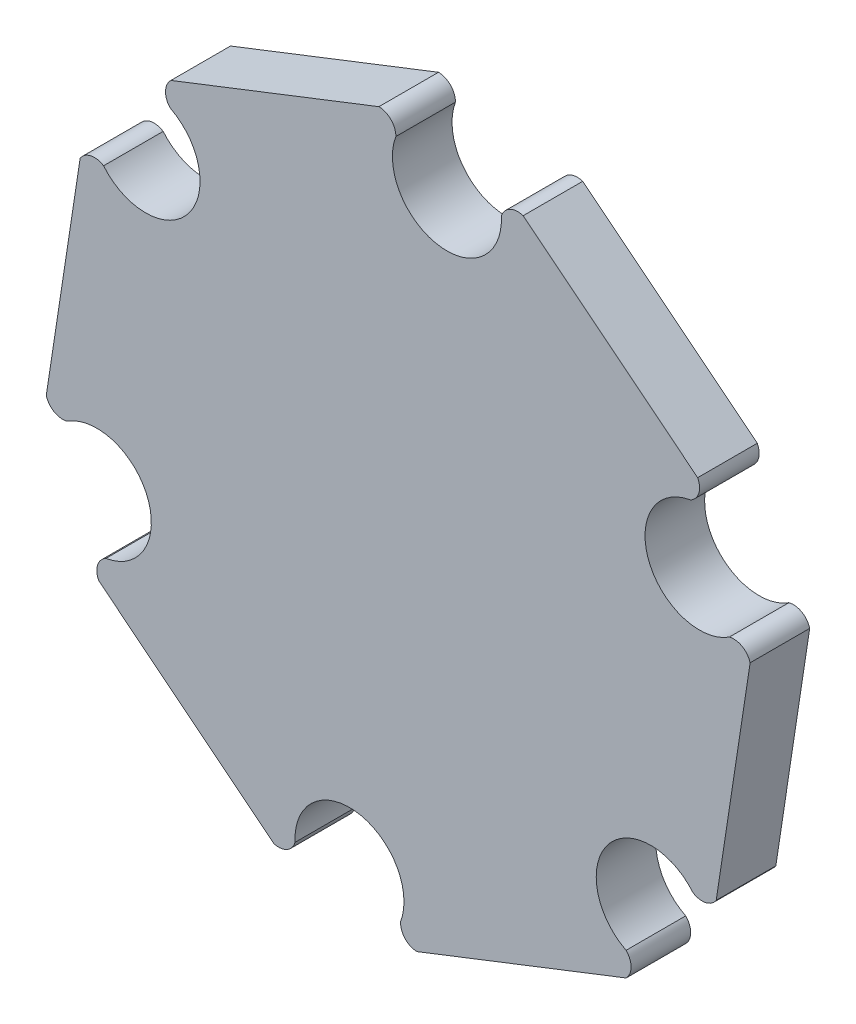
ISO-10303-21;
HEADER;
FILE_DESCRIPTION(('STEP AP214'),'2;1');
FILE_NAME('part.step','',(''),(''),'','','');
FILE_SCHEMA(('AUTOMOTIVE_DESIGN { 1 0 10303 214 1 1 1 1 }'));
ENDSEC;
DATA;
#1=APPLICATION_CONTEXT('core data for automotive mechanical design processes');
#2=APPLICATION_PROTOCOL_DEFINITION('international standard','automotive_design',2000,#1);
#3=PRODUCT_CONTEXT('',#1,'mechanical');
#4=PRODUCT('Part','Part','',(#3));
#5=PRODUCT_RELATED_PRODUCT_CATEGORY('part','',(#4));
#6=PRODUCT_DEFINITION_FORMATION('','',#4);
#7=PRODUCT_DEFINITION_CONTEXT('part definition',#1,'design');
#8=PRODUCT_DEFINITION('design','',#6,#7);
#9=PRODUCT_DEFINITION_SHAPE('','',#8);
#10=(LENGTH_UNIT() NAMED_UNIT(*) SI_UNIT(.MILLI.,.METRE.));
#11=(NAMED_UNIT(*) PLANE_ANGLE_UNIT() SI_UNIT($,.RADIAN.));
#12=(NAMED_UNIT(*) SI_UNIT($,.STERADIAN.) SOLID_ANGLE_UNIT());
#13=UNCERTAINTY_MEASURE_WITH_UNIT(LENGTH_MEASURE(1.E-05),#10,'distance_accuracy_value','');
#14=(GEOMETRIC_REPRESENTATION_CONTEXT(3) GLOBAL_UNCERTAINTY_ASSIGNED_CONTEXT((#13)) GLOBAL_UNIT_ASSIGNED_CONTEXT((#10,
#11,#12)) REPRESENTATION_CONTEXT('',''));
#15=CARTESIAN_POINT('',(0.,0.,0.));
#16=DIRECTION('',(0.,0.,1.));
#17=DIRECTION('',(1.,0.,0.));
#18=AXIS2_PLACEMENT_3D('',#15,#16,#17);
#19=CARTESIAN_POINT('',(-23.0759580428139,-0.467663959101005,1.75));
#20=DIRECTION('',(0.,0.,-1.));
#21=DIRECTION('',(-1.,0.,0.));
#22=AXIS2_PLACEMENT_3D('',#19,#20,#21);
#23=CYLINDRICAL_SURFACE('',#22,0.498378190085756);
#24=CARTESIAN_POINT('',(-23.0759580428139,-0.467663959101005,0.));
#25=DIRECTION('',(0.,0.,1.));
#26=DIRECTION('',(1.,0.,0.));
#27=AXIS2_PLACEMENT_3D('',#24,#25,#26);
#28=CIRCLE('',#27,0.498378190085756);
#29=CARTESIAN_POINT('',(-23.5180099099412,-0.697818183747076,0.));
#30=VERTEX_POINT('',#29);
#31=CARTESIAN_POINT('',(-23.3061122674605,-0.0256120919740345,0.));
#32=VERTEX_POINT('',#31);
#33=EDGE_CURVE('E224',#30,#32,#28,.F.);
#34=ORIENTED_EDGE('',*,*,#33,.F.);
#35=DIRECTION('',(0.,0.,-1.));
#36=VECTOR('',#35,1.);
#37=CARTESIAN_POINT('',(-23.5180099099412,-0.697818183747076,1.75));
#38=LINE('',#37,#36);
#39=CARTESIAN_POINT('',(-23.5180099099412,-0.697818183747076,1.75));
#40=VERTEX_POINT('',#39);
#41=EDGE_CURVE('E11',#40,#30,#38,.T.);
#42=ORIENTED_EDGE('',*,*,#41,.F.);
#43=CARTESIAN_POINT('',(-23.0759580428139,-0.467663959101005,1.75));
#44=DIRECTION('',(0.,0.,1.));
#45=DIRECTION('',(1.,0.,0.));
#46=AXIS2_PLACEMENT_3D('',#43,#44,#45);
#47=CIRCLE('',#46,0.498378190085756);
#48=CARTESIAN_POINT('',(-23.3061122674605,-0.0256120919740345,1.75));
#49=VERTEX_POINT('',#48);
#50=EDGE_CURVE('E292',#40,#49,#47,.F.);
#51=ORIENTED_EDGE('',*,*,#50,.T.);
#52=DIRECTION('',(0.,0.,-1.));
#53=VECTOR('',#52,1.);
#54=CARTESIAN_POINT('',(-23.3061122674605,-0.0256120919740345,1.75));
#55=LINE('',#54,#53);
#56=EDGE_CURVE('E50',#49,#32,#55,.T.);
#57=ORIENTED_EDGE('',*,*,#56,.T.);
#58=EDGE_LOOP('',(#34,#42,#51,#57));
#59=FACE_BOUND('',#58,.T.);
#60=ADVANCED_FACE('F34',(#59),#23,.T.);
#61=CARTESIAN_POINT('',(-9.51815907888062,-11.8976988485981,1.75));
#62=DIRECTION('',(0.624695047554511,0.780868809442961,0.));
#63=DIRECTION('',(-0.780868809442961,0.624695047554511,0.));
#64=AXIS2_PLACEMENT_3D('',#61,#62,#63);
#65=PLANE('',#64);
#66=DIRECTION('',(0.780868809442961,-0.624695047554511,0.));
#67=VECTOR('',#66,1.);
#68=CARTESIAN_POINT('',(-9.51815907888062,-11.8976988485981,0.));
#69=LINE('',#68,#67);
#70=CARTESIAN_POINT('',(-18.3710955944245,-4.81534963616135,0.));
#71=VERTEX_POINT('',#70);
#72=EDGE_CURVE('E226',#30,#71,#69,.T.);
#73=ORIENTED_EDGE('',*,*,#72,.T.);
#74=DIRECTION('',(0.,0.,-1.));
#75=VECTOR('',#74,1.);
#76=CARTESIAN_POINT('',(-18.3710955944245,-4.81534963616135,1.75));
#77=LINE('',#76,#75);
#78=CARTESIAN_POINT('',(-18.3710955944245,-4.81534963616135,1.75));
#79=VERTEX_POINT('',#78);
#80=EDGE_CURVE('E42',#79,#71,#77,.T.);
#81=ORIENTED_EDGE('',*,*,#80,.F.);
#82=DIRECTION('',(0.780868809442961,-0.624695047554511,0.));
#83=VECTOR('',#82,1.);
#84=CARTESIAN_POINT('',(-9.51815907888062,-11.8976988485981,1.75));
#85=LINE('',#84,#83);
#86=EDGE_CURVE('E353',#40,#79,#85,.T.);
#87=ORIENTED_EDGE('',*,*,#86,.F.);
#88=ORIENTED_EDGE('',*,*,#41,.T.);
#89=EDGE_LOOP('',(#73,#81,#87,#88));
#90=FACE_BOUND('',#89,.T.);
#91=ADVANCED_FACE('F340',(#90),#65,.F.);
#92=CARTESIAN_POINT('',(-18.2347643282595,-4.33257715894294,1.75));
#93=DIRECTION('',(0.,0.,-1.));
#94=DIRECTION('',(-1.,0.,0.));
#95=AXIS2_PLACEMENT_3D('',#92,#93,#94);
#96=CYLINDRICAL_SURFACE('',#95,0.501652747319982);
#97=CARTESIAN_POINT('',(-18.2347643282595,-4.33257715894294,0.));
#98=DIRECTION('',(0.,0.,1.));
#99=DIRECTION('',(1.,0.,0.));
#100=AXIS2_PLACEMENT_3D('',#97,#98,#99);
#101=CIRCLE('',#100,0.501652747319982);
#102=CARTESIAN_POINT('',(-17.7519918510414,-4.46890842510842,0.));
#103=VERTEX_POINT('',#102);
#104=EDGE_CURVE('E229',#103,#71,#101,.F.);
#105=ORIENTED_EDGE('',*,*,#104,.F.);
#106=DIRECTION('',(0.,0.,-1.));
#107=VECTOR('',#106,1.);
#108=CARTESIAN_POINT('',(-17.7519918510414,-4.46890842510842,1.75));
#109=LINE('',#108,#107);
#110=CARTESIAN_POINT('',(-17.7519918510414,-4.46890842510842,1.75));
#111=VERTEX_POINT('',#110);
#112=EDGE_CURVE('E330',#111,#103,#109,.T.);
#113=ORIENTED_EDGE('',*,*,#112,.F.);
#114=CARTESIAN_POINT('',(-18.2347643282595,-4.33257715894294,1.75));
#115=DIRECTION('',(0.,0.,1.));
#116=DIRECTION('',(1.,0.,0.));
#117=AXIS2_PLACEMENT_3D('',#114,#115,#116);
#118=CIRCLE('',#117,0.501652747319982);
#119=EDGE_CURVE('E337',#111,#79,#118,.F.);
#120=ORIENTED_EDGE('',*,*,#119,.T.);
#121=ORIENTED_EDGE('',*,*,#80,.T.);
#122=EDGE_LOOP('',(#105,#113,#120,#121));
#123=FACE_BOUND('',#122,.T.);
#124=ADVANCED_FACE('F335',(#123),#96,.T.);
#125=CARTESIAN_POINT('',(-16.1543235823746,-4.38255969439806,1.75));
#126=DIRECTION('',(0.,0.,-1.));
#127=DIRECTION('',(-1.,0.,0.));
#128=AXIS2_PLACEMENT_3D('',#125,#126,#127);
#129=CYLINDRICAL_SURFACE('',#128,1.6);
#130=CARTESIAN_POINT('',(-16.1543235823746,-4.38255969439806,0.));
#131=DIRECTION('',(0.,0.,1.));
#132=DIRECTION('',(1.,0.,0.));
#133=AXIS2_PLACEMENT_3D('',#130,#131,#132);
#134=CIRCLE('',#133,1.6);
#135=CARTESIAN_POINT('',(-14.6548014691151,-4.94062190584571,0.));
#136=VERTEX_POINT('',#135);
#137=EDGE_CURVE('E232',#136,#103,#134,.T.);
#138=ORIENTED_EDGE('',*,*,#137,.F.);
#139=DIRECTION('',(0.,0.,-1.));
#140=VECTOR('',#139,1.);
#141=CARTESIAN_POINT('',(-14.6548014691151,-4.94062190584571,1.75));
#142=LINE('',#141,#140);
#143=CARTESIAN_POINT('',(-14.6548014691151,-4.94062190584571,1.75));
#144=VERTEX_POINT('',#143);
#145=EDGE_CURVE('E328',#144,#136,#142,.T.);
#146=ORIENTED_EDGE('',*,*,#145,.F.);
#147=CARTESIAN_POINT('',(-16.1543235823746,-4.38255969439806,1.75));
#148=DIRECTION('',(0.,0.,1.));
#149=DIRECTION('',(1.,0.,0.));
#150=AXIS2_PLACEMENT_3D('',#147,#148,#149);
#151=CIRCLE('',#150,1.6);
#152=EDGE_CURVE('E350',#144,#111,#151,.T.);
#153=ORIENTED_EDGE('',*,*,#152,.T.);
#154=ORIENTED_EDGE('',*,*,#112,.T.);
#155=EDGE_LOOP('',(#138,#146,#153,#154));
#156=FACE_BOUND('',#155,.T.);
#157=ADVANCED_FACE('F347',(#156),#129,.F.);
#158=CARTESIAN_POINT('',(-14.1568962100695,-4.96232843407788,1.75));
#159=DIRECTION('',(0.,0.,-1.));
#160=DIRECTION('',(-1.,0.,0.));
#161=AXIS2_PLACEMENT_3D('',#158,#159,#160);
#162=CYLINDRICAL_SURFACE('',#161,0.498378190085832);
#163=CARTESIAN_POINT('',(-14.1568962100695,-4.96232843407788,0.));
#164=DIRECTION('',(0.,0.,1.));
#165=DIRECTION('',(1.,0.,0.));
#166=AXIS2_PLACEMENT_3D('',#163,#164,#165);
#167=CIRCLE('',#166,0.498378190085832);
#168=CARTESIAN_POINT('',(-14.1786027383026,-5.46023369312352,0.));
#169=VERTEX_POINT('',#168);
#170=EDGE_CURVE('E235',#169,#136,#167,.F.);
#171=ORIENTED_EDGE('',*,*,#170,.F.);
#172=DIRECTION('',(0.,0.,-1.));
#173=VECTOR('',#172,1.);
#174=CARTESIAN_POINT('',(-14.1786027383026,-5.46023369312352,1.75));
#175=LINE('',#174,#173);
#176=CARTESIAN_POINT('',(-14.1786027383026,-5.46023369312352,1.75));
#177=VERTEX_POINT('',#176);
#178=EDGE_CURVE('E326',#177,#169,#175,.T.);
#179=ORIENTED_EDGE('',*,*,#178,.F.);
#180=CARTESIAN_POINT('',(-14.1568962100695,-4.96232843407788,1.75));
#181=DIRECTION('',(0.,0.,1.));
#182=DIRECTION('',(1.,0.,0.));
#183=AXIS2_PLACEMENT_3D('',#180,#181,#182);
#184=CIRCLE('',#183,0.498378190085832);
#185=EDGE_CURVE('E355',#177,#144,#184,.F.);
#186=ORIENTED_EDGE('',*,*,#185,.T.);
#187=ORIENTED_EDGE('',*,*,#145,.T.);
#188=EDGE_LOOP('',(#171,#179,#186,#187));
#189=FACE_BOUND('',#188,.T.);
#190=ADVANCED_FACE('F427',(#189),#162,.T.);
#191=CARTESIAN_POINT('',(-0.0268565179163278,0.0687408886215518,1.75));
#192=DIRECTION('',(-0.363904702223259,0.931436185522015,0.));
#193=DIRECTION('',(-0.931436185522015,-0.363904702223259,0.));
#194=AXIS2_PLACEMENT_3D('',#191,#192,#193);
#195=PLANE('',#194);
#196=DIRECTION('',(0.931436185522015,0.363904702223259,0.));
#197=VECTOR('',#196,1.);
#198=CARTESIAN_POINT('',(-0.0268565179163278,0.0687408886215518,0.));
#199=LINE('',#198,#197);
#200=CARTESIAN_POINT('',(-8.03038567854152,-3.05817423578945,0.));
#201=VERTEX_POINT('',#200);
#202=EDGE_CURVE('E238',#169,#201,#199,.T.);
#203=ORIENTED_EDGE('',*,*,#202,.T.);
#204=DIRECTION('',(0.,0.,-1.));
#205=VECTOR('',#204,1.);
#206=CARTESIAN_POINT('',(-8.03038567854152,-3.05817423578945,1.75));
#207=LINE('',#206,#205);
#208=CARTESIAN_POINT('',(-8.03038567854152,-3.05817423578945,1.75));
#209=VERTEX_POINT('',#208);
#210=EDGE_CURVE('E324',#209,#201,#207,.T.);
#211=ORIENTED_EDGE('',*,*,#210,.F.);
#212=DIRECTION('',(0.931436185522015,0.363904702223259,0.));
#213=VECTOR('',#212,1.);
#214=CARTESIAN_POINT('',(-0.0268565179163278,0.0687408886215518,1.75));
#215=LINE('',#214,#213);
#216=EDGE_CURVE('E361',#177,#209,#215,.T.);
#217=ORIENTED_EDGE('',*,*,#216,.F.);
#218=ORIENTED_EDGE('',*,*,#178,.T.);
#219=EDGE_LOOP('',(#203,#211,#217,#218));
#220=FACE_BOUND('',#219,.T.);
#221=ADVANCED_FACE('F430',(#220),#195,.F.);
#222=CARTESIAN_POINT('',(-8.38313249875513,-2.70732652745627,1.75));
#223=DIRECTION('',(0.,0.,-1.));
#224=DIRECTION('',(-1.,0.,0.));
#225=AXIS2_PLACEMENT_3D('',#222,#223,#224);
#226=CYLINDRICAL_SURFACE('',#225,0.497518274652765);
#227=CARTESIAN_POINT('',(-8.38313249875513,-2.70732652745627,0.));
#228=DIRECTION('',(0.,0.,1.));
#229=DIRECTION('',(1.,0.,0.));
#230=AXIS2_PLACEMENT_3D('',#227,#228,#229);
#231=CIRCLE('',#230,0.497518274652765);
#232=CARTESIAN_POINT('',(-8.03228479042112,-2.35457970724346,0.));
#233=VERTEX_POINT('',#232);
#234=EDGE_CURVE('E241',#233,#201,#231,.F.);
#235=ORIENTED_EDGE('',*,*,#234,.F.);
#236=DIRECTION('',(0.,0.,-1.));
#237=VECTOR('',#236,1.);
#238=CARTESIAN_POINT('',(-8.03228479042112,-2.35457970724346,1.75));
#239=LINE('',#238,#237);
#240=CARTESIAN_POINT('',(-8.03228479042112,-2.35457970724346,1.75));
#241=VERTEX_POINT('',#240);
#242=EDGE_CURVE('E322',#241,#233,#239,.T.);
#243=ORIENTED_EDGE('',*,*,#242,.F.);
#244=CARTESIAN_POINT('',(-8.38313249875513,-2.70732652745627,1.75));
#245=DIRECTION('',(0.,0.,1.));
#246=DIRECTION('',(1.,0.,0.));
#247=AXIS2_PLACEMENT_3D('',#244,#245,#246);
#248=CIRCLE('',#247,0.497518274652765);
#249=EDGE_CURVE('E363',#241,#209,#248,.F.);
#250=ORIENTED_EDGE('',*,*,#249,.T.);
#251=ORIENTED_EDGE('',*,*,#210,.T.);
#252=EDGE_LOOP('',(#235,#243,#250,#251));
#253=FACE_BOUND('',#252,.T.);
#254=ADVANCED_FACE('F434',(#253),#226,.T.);
#255=CARTESIAN_POINT('',(-7.30567981991642,-0.925465023276436,1.75));
#256=DIRECTION('',(0.,0.,-1.));
#257=DIRECTION('',(-1.,0.,0.));
#258=AXIS2_PLACEMENT_3D('',#255,#256,#257);
#259=CYLINDRICAL_SURFACE('',#258,1.6032228675678);
#260=CARTESIAN_POINT('',(-7.30567981991642,-0.925465023276436,0.));
#261=DIRECTION('',(0.,0.,1.));
#262=DIRECTION('',(1.,0.,0.));
#263=AXIS2_PLACEMENT_3D('',#260,#261,#262);
#264=CIRCLE('',#263,1.6032228675678);
#265=CARTESIAN_POINT('',(-6.07092024372107,0.0971259761393516,0.));
#266=VERTEX_POINT('',#265);
#267=EDGE_CURVE('E244',#266,#233,#264,.T.);
#268=ORIENTED_EDGE('',*,*,#267,.F.);
#269=DIRECTION('',(0.,0.,-1.));
#270=VECTOR('',#269,1.);
#271=CARTESIAN_POINT('',(-6.07092024372107,0.0971259761393516,1.75));
#272=LINE('',#271,#270);
#273=CARTESIAN_POINT('',(-6.07092024372107,0.0971259761393516,1.75));
#274=VERTEX_POINT('',#273);
#275=EDGE_CURVE('E320',#274,#266,#272,.T.);
#276=ORIENTED_EDGE('',*,*,#275,.F.);
#277=CARTESIAN_POINT('',(-7.30567981991642,-0.925465023276436,1.75));
#278=DIRECTION('',(0.,0.,1.));
#279=DIRECTION('',(1.,0.,0.));
#280=AXIS2_PLACEMENT_3D('',#277,#278,#279);
#281=CIRCLE('',#280,1.6032228675678);
#282=EDGE_CURVE('E366',#274,#241,#281,.T.);
#283=ORIENTED_EDGE('',*,*,#282,.T.);
#284=ORIENTED_EDGE('',*,*,#242,.T.);
#285=EDGE_LOOP('',(#268,#276,#283,#284));
#286=FACE_BOUND('',#285,.T.);
#287=ADVANCED_FACE('F438',(#286),#259,.F.);
#288=CARTESIAN_POINT('',(-5.79929744653299,0.510738563501488,1.75));
#289=DIRECTION('',(0.,0.,-1.));
#290=DIRECTION('',(-1.,0.,0.));
#291=AXIS2_PLACEMENT_3D('',#288,#289,#290);
#292=CYLINDRICAL_SURFACE('',#291,0.494827562264576);
#293=CARTESIAN_POINT('',(-5.79929744653299,0.510738563501488,0.));
#294=DIRECTION('',(0.,0.,1.));
#295=DIRECTION('',(1.,0.,0.));
#296=AXIS2_PLACEMENT_3D('',#293,#294,#295);
#297=CIRCLE('',#296,0.494827562264576);
#298=CARTESIAN_POINT('',(-5.38568485917003,0.239115766314577,0.));
#299=VERTEX_POINT('',#298);
#300=EDGE_CURVE('E247',#299,#266,#297,.F.);
#301=ORIENTED_EDGE('',*,*,#300,.F.);
#302=DIRECTION('',(0.,0.,-1.));
#303=VECTOR('',#302,1.);
#304=CARTESIAN_POINT('',(-5.38568485917003,0.239115766314577,1.75));
#305=LINE('',#304,#303);
#306=CARTESIAN_POINT('',(-5.38568485917003,0.239115766314577,1.75));
#307=VERTEX_POINT('',#306);
#308=EDGE_CURVE('E318',#307,#299,#305,.T.);
#309=ORIENTED_EDGE('',*,*,#308,.F.);
#310=CARTESIAN_POINT('',(-5.79929744653299,0.510738563501488,1.75));
#311=DIRECTION('',(0.,0.,1.));
#312=DIRECTION('',(1.,0.,0.));
#313=AXIS2_PLACEMENT_3D('',#310,#311,#312);
#314=CIRCLE('',#313,0.494827562264576);
#315=EDGE_CURVE('E369',#307,#274,#314,.F.);
#316=ORIENTED_EDGE('',*,*,#315,.T.);
#317=ORIENTED_EDGE('',*,*,#275,.T.);
#318=EDGE_LOOP('',(#301,#309,#316,#317));
#319=FACE_BOUND('',#318,.T.);
#320=ADVANCED_FACE('F442',(#319),#292,.T.);
#321=CARTESIAN_POINT('',(-5.29918109339743,0.807084760824531,1.75));
#322=DIRECTION('',(-0.98859974977777,0.150567376079054,0.));
#323=DIRECTION('',(-0.150567376079054,-0.98859974977777,0.));
#324=AXIS2_PLACEMENT_3D('',#321,#322,#323);
#325=PLANE('',#324);
#326=DIRECTION('',(0.150567376079054,0.98859974977777,0.));
#327=VECTOR('',#326,1.);
#328=CARTESIAN_POINT('',(-5.29918109339743,0.807084760824531,0.));
#329=LINE('',#328,#327);
#330=CARTESIAN_POINT('',(-4.38972071694264,6.77844671192841,0.));
#331=VERTEX_POINT('',#330);
#332=EDGE_CURVE('E250',#299,#331,#329,.T.);
#333=ORIENTED_EDGE('',*,*,#332,.T.);
#334=DIRECTION('',(0.,0.,-1.));
#335=VECTOR('',#334,1.);
#336=CARTESIAN_POINT('',(-4.38972071694264,6.77844671192841,1.75));
#337=LINE('',#336,#335);
#338=CARTESIAN_POINT('',(-4.38972071694264,6.77844671192841,1.75));
#339=VERTEX_POINT('',#338);
#340=EDGE_CURVE('E316',#339,#331,#337,.T.);
#341=ORIENTED_EDGE('',*,*,#340,.F.);
#342=DIRECTION('',(0.150567376079054,0.98859974977777,0.));
#343=VECTOR('',#342,1.);
#344=CARTESIAN_POINT('',(-5.29918109339743,0.807084760824531,1.75));
#345=LINE('',#344,#343);
#346=EDGE_CURVE('E372',#307,#339,#345,.T.);
#347=ORIENTED_EDGE('',*,*,#346,.F.);
#348=ORIENTED_EDGE('',*,*,#308,.T.);
#349=EDGE_LOOP('',(#333,#341,#347,#348));
#350=FACE_BOUND('',#349,.T.);
#351=ADVANCED_FACE('F446',(#350),#325,.F.);
#352=CARTESIAN_POINT('',(-4.86993789009273,6.6451339707334,1.75));
#353=DIRECTION('',(0.,0.,-1.));
#354=DIRECTION('',(-1.,0.,0.));
#355=AXIS2_PLACEMENT_3D('',#352,#353,#354);
#356=CYLINDRICAL_SURFACE('',#355,0.498378190085882);
#357=CARTESIAN_POINT('',(-4.86993789009273,6.6451339707334,0.));
#358=DIRECTION('',(0.,0.,1.));
#359=DIRECTION('',(1.,0.,0.));
#360=AXIS2_PLACEMENT_3D('',#357,#358,#359);
#361=CIRCLE('',#360,0.498378190085882);
#362=CARTESIAN_POINT('',(-5.00167541845313,7.12578565748261,0.));
#363=VERTEX_POINT('',#362);
#364=EDGE_CURVE('E253',#363,#331,#361,.F.);
#365=ORIENTED_EDGE('',*,*,#364,.F.);
#366=DIRECTION('',(0.,0.,-1.));
#367=VECTOR('',#366,1.);
#368=CARTESIAN_POINT('',(-5.00167541845313,7.12578565748261,1.75));
#369=LINE('',#368,#367);
#370=CARTESIAN_POINT('',(-5.00167541845313,7.12578565748261,1.75));
#371=VERTEX_POINT('',#370);
#372=EDGE_CURVE('E314',#371,#363,#369,.T.);
#373=ORIENTED_EDGE('',*,*,#372,.F.);
#374=CARTESIAN_POINT('',(-4.86993789009273,6.6451339707334,1.75));
#375=DIRECTION('',(0.,0.,1.));
#376=DIRECTION('',(1.,0.,0.));
#377=AXIS2_PLACEMENT_3D('',#374,#375,#376);
#378=CIRCLE('',#377,0.498378190085882);
#379=EDGE_CURVE('E374',#371,#339,#378,.F.);
#380=ORIENTED_EDGE('',*,*,#379,.T.);
#381=ORIENTED_EDGE('',*,*,#340,.T.);
#382=EDGE_LOOP('',(#365,#373,#380,#381));
#383=FACE_BOUND('',#382,.T.);
#384=ADVANCED_FACE('F450',(#383),#356,.T.);
#385=CARTESIAN_POINT('',(-5.87528974716543,8.46623259961247,1.75));
#386=DIRECTION('',(0.,0.,-1.));
#387=DIRECTION('',(-1.,0.,0.));
#388=AXIS2_PLACEMENT_3D('',#385,#386,#387);
#389=CYLINDRICAL_SURFACE('',#388,1.59999999999898);
#390=CARTESIAN_POINT('',(-5.87528974716543,8.46623259961247,0.));
#391=DIRECTION('',(0.,0.,1.));
#392=DIRECTION('',(1.,0.,0.));
#393=AXIS2_PLACEMENT_3D('',#390,#391,#392);
#394=CIRCLE('',#393,1.59999999999898);
#395=CARTESIAN_POINT('',(-6.14175475178946,10.0438879489545,0.));
#396=VERTEX_POINT('',#395);
#397=EDGE_CURVE('E256',#396,#363,#394,.T.);
#398=ORIENTED_EDGE('',*,*,#397,.F.);
#399=DIRECTION('',(0.,0.,-1.));
#400=VECTOR('',#399,1.);
#401=CARTESIAN_POINT('',(-6.14175475178946,10.0438879489545,1.75));
#402=LINE('',#401,#400);
#403=CARTESIAN_POINT('',(-6.14175475178946,10.0438879489545,1.75));
#404=VERTEX_POINT('',#403);
#405=EDGE_CURVE('E312',#404,#396,#402,.T.);
#406=ORIENTED_EDGE('',*,*,#405,.F.);
#407=CARTESIAN_POINT('',(-5.87528974716543,8.46623259961247,1.75));
#408=DIRECTION('',(0.,0.,1.));
#409=DIRECTION('',(1.,0.,0.));
#410=AXIS2_PLACEMENT_3D('',#407,#408,#409);
#411=CIRCLE('',#410,1.59999999999898);
#412=EDGE_CURVE('E377',#404,#371,#411,.T.);
#413=ORIENTED_EDGE('',*,*,#412,.T.);
#414=ORIENTED_EDGE('',*,*,#372,.T.);
#415=EDGE_LOOP('',(#398,#406,#413,#414));
#416=FACE_BOUND('',#415,.T.);
#417=ADVANCED_FACE('F454',(#416),#389,.F.);
#418=CARTESIAN_POINT('',(-6.37190897643537,10.4859398160821,1.75));
#419=DIRECTION('',(0.,0.,-1.));
#420=DIRECTION('',(-1.,0.,0.));
#421=AXIS2_PLACEMENT_3D('',#418,#419,#420);
#422=CYLINDRICAL_SURFACE('',#421,0.498378190086075);
#423=CARTESIAN_POINT('',(-6.37190897643537,10.4859398160821,0.));
#424=DIRECTION('',(0.,0.,1.));
#425=DIRECTION('',(1.,0.,0.));
#426=AXIS2_PLACEMENT_3D('',#423,#424,#425);
#427=CIRCLE('',#426,0.498378190086075);
#428=CARTESIAN_POINT('',(-5.92985710930737,10.7160940407277,0.));
#429=VERTEX_POINT('',#428);
#430=EDGE_CURVE('E259',#429,#396,#427,.F.);
#431=ORIENTED_EDGE('',*,*,#430,.F.);
#432=DIRECTION('',(0.,0.,-1.));
#433=VECTOR('',#432,1.);
#434=CARTESIAN_POINT('',(-5.92985710930737,10.7160940407277,1.75));
#435=LINE('',#434,#433);
#436=CARTESIAN_POINT('',(-5.92985710930737,10.7160940407277,1.75));
#437=VERTEX_POINT('',#436);
#438=EDGE_CURVE('E310',#437,#429,#435,.T.);
#439=ORIENTED_EDGE('',*,*,#438,.F.);
#440=CARTESIAN_POINT('',(-6.37190897643537,10.4859398160821,1.75));
#441=DIRECTION('',(0.,0.,1.));
#442=DIRECTION('',(1.,0.,0.));
#443=AXIS2_PLACEMENT_3D('',#440,#441,#442);
#444=CIRCLE('',#443,0.498378190086075);
#445=EDGE_CURVE('E380',#437,#404,#444,.F.);
#446=ORIENTED_EDGE('',*,*,#445,.T.);
#447=ORIENTED_EDGE('',*,*,#405,.T.);
#448=EDGE_LOOP('',(#431,#439,#446,#447));
#449=FACE_BOUND('',#448,.T.);
#450=ADVANCED_FACE('F458',(#449),#422,.T.);
#451=CARTESIAN_POINT('',(2.91327236745416,3.64159045931688,1.75));
#452=DIRECTION('',(-0.624695047554511,-0.780868809442961,0.));
#453=DIRECTION('',(0.780868809442961,-0.624695047554511,0.));
#454=AXIS2_PLACEMENT_3D('',#451,#452,#453);
#455=PLANE('',#454);
#456=DIRECTION('',(-0.780868809442961,0.624695047554511,0.));
#457=VECTOR('',#456,1.);
#458=CARTESIAN_POINT('',(2.91327236745416,3.64159045931688,0.));
#459=LINE('',#458,#457);
#460=CARTESIAN_POINT('',(-11.0542755053668,14.8156287575762,0.));
#461=VERTEX_POINT('',#460);
#462=EDGE_CURVE('E262',#429,#461,#459,.T.);
#463=ORIENTED_EDGE('',*,*,#462,.T.);
#464=DIRECTION('',(0.,0.,-1.));
#465=VECTOR('',#464,1.);
#466=CARTESIAN_POINT('',(-11.0542755053668,14.8156287575762,1.75));
#467=LINE('',#466,#465);
#468=CARTESIAN_POINT('',(-11.0542755053668,14.8156287575762,1.75));
#469=VERTEX_POINT('',#468);
#470=EDGE_CURVE('E308',#469,#461,#467,.T.);
#471=ORIENTED_EDGE('',*,*,#470,.F.);
#472=DIRECTION('',(-0.780868809442961,0.624695047554511,0.));
#473=VECTOR('',#472,1.);
#474=CARTESIAN_POINT('',(2.91327236745416,3.64159045931688,1.75));
#475=LINE('',#474,#473);
#476=EDGE_CURVE('E383',#437,#469,#475,.T.);
#477=ORIENTED_EDGE('',*,*,#476,.F.);
#478=ORIENTED_EDGE('',*,*,#438,.T.);
#479=EDGE_LOOP('',(#463,#471,#477,#478));
#480=FACE_BOUND('',#479,.T.);
#481=ADVANCED_FACE('F462',(#480),#455,.F.);
#482=CARTESIAN_POINT('',(-11.2108530990451,14.3306066884133,1.75));
#483=DIRECTION('',(0.,0.,-1.));
#484=DIRECTION('',(-1.,0.,0.));
#485=AXIS2_PLACEMENT_3D('',#482,#483,#484);
#486=CYLINDRICAL_SURFACE('',#485,0.509669452113076);
#487=CARTESIAN_POINT('',(-11.2108530990451,14.3306066884133,0.));
#488=DIRECTION('',(0.,0.,1.));
#489=DIRECTION('',(1.,0.,0.));
#490=AXIS2_PLACEMENT_3D('',#487,#488,#489);
#491=CIRCLE('',#490,0.509669452113076);
#492=CARTESIAN_POINT('',(-11.6958751682088,14.4871842820895,0.));
#493=VERTEX_POINT('',#492);
#494=EDGE_CURVE('E265',#493,#461,#491,.F.);
#495=ORIENTED_EDGE('',*,*,#494,.F.);
#496=DIRECTION('',(0.,0.,-1.));
#497=VECTOR('',#496,1.);
#498=CARTESIAN_POINT('',(-11.6958751682088,14.4871842820895,1.75));
#499=LINE('',#498,#497);
#500=CARTESIAN_POINT('',(-11.6958751682088,14.4871842820895,1.75));
#501=VERTEX_POINT('',#500);
#502=EDGE_CURVE('E306',#501,#493,#499,.T.);
#503=ORIENTED_EDGE('',*,*,#502,.F.);
#504=CARTESIAN_POINT('',(-11.2108530990451,14.3306066884133,1.75));
#505=DIRECTION('',(0.,0.,1.));
#506=DIRECTION('',(1.,0.,0.));
#507=AXIS2_PLACEMENT_3D('',#504,#505,#506);
#508=CIRCLE('',#507,0.509669452113076);
#509=EDGE_CURVE('E385',#501,#469,#508,.F.);
#510=ORIENTED_EDGE('',*,*,#509,.T.);
#511=ORIENTED_EDGE('',*,*,#470,.T.);
#512=EDGE_LOOP('',(#495,#503,#510,#511));
#513=FACE_BOUND('',#512,.T.);
#514=ADVANCED_FACE('F466',(#513),#486,.T.);
#515=CARTESIAN_POINT('',(-13.2935434368745,14.4008355513795,1.75));
#516=DIRECTION('',(0.,0.,-1.));
#517=DIRECTION('',(-1.,0.,0.));
#518=AXIS2_PLACEMENT_3D('',#515,#516,#517);
#519=CYLINDRICAL_SURFACE('',#518,1.59999999999895);
#520=CARTESIAN_POINT('',(-13.2935434368745,14.4008355513795,0.));
#521=DIRECTION('',(0.,0.,1.));
#522=DIRECTION('',(1.,0.,0.));
#523=AXIS2_PLACEMENT_3D('',#520,#521,#522);
#524=CIRCLE('',#523,1.59999999999895);
#525=CARTESIAN_POINT('',(-14.7930655501329,14.9588977628272,0.));
#526=VERTEX_POINT('',#525);
#527=EDGE_CURVE('E268',#526,#493,#524,.T.);
#528=ORIENTED_EDGE('',*,*,#527,.F.);
#529=DIRECTION('',(0.,0.,-1.));
#530=VECTOR('',#529,1.);
#531=CARTESIAN_POINT('',(-14.7930655501329,14.9588977628272,1.75));
#532=LINE('',#531,#530);
#533=CARTESIAN_POINT('',(-14.7930655501329,14.9588977628272,1.75));
#534=VERTEX_POINT('',#533);
#535=EDGE_CURVE('E304',#534,#526,#532,.T.);
#536=ORIENTED_EDGE('',*,*,#535,.F.);
#537=CARTESIAN_POINT('',(-13.2935434368745,14.4008355513795,1.75));
#538=DIRECTION('',(0.,0.,1.));
#539=DIRECTION('',(1.,0.,0.));
#540=AXIS2_PLACEMENT_3D('',#537,#538,#539);
#541=CIRCLE('',#540,1.59999999999895);
#542=EDGE_CURVE('E388',#534,#501,#541,.T.);
#543=ORIENTED_EDGE('',*,*,#542,.T.);
#544=ORIENTED_EDGE('',*,*,#502,.T.);
#545=EDGE_LOOP('',(#528,#536,#543,#544));
#546=FACE_BOUND('',#545,.T.);
#547=ADVANCED_FACE('F470',(#546),#519,.F.);
#548=CARTESIAN_POINT('',(-15.2971657753287,14.9664648235782,1.75));
#549=DIRECTION('',(0.,0.,-1.));
#550=DIRECTION('',(-1.,0.,0.));
#551=AXIS2_PLACEMENT_3D('',#548,#549,#550);
#552=CYLINDRICAL_SURFACE('',#551,0.504157016663357);
#553=CARTESIAN_POINT('',(-15.2971657753287,14.9664648235782,0.));
#554=DIRECTION('',(0.,0.,1.));
#555=DIRECTION('',(1.,0.,0.));
#556=AXIS2_PLACEMENT_3D('',#553,#554,#555);
#557=CIRCLE('',#556,0.504157016663357);
#558=CARTESIAN_POINT('',(-15.2895987145793,15.4705650487742,0.));
#559=VERTEX_POINT('',#558);
#560=EDGE_CURVE('E271',#559,#526,#557,.F.);
#561=ORIENTED_EDGE('',*,*,#560,.F.);
#562=DIRECTION('',(0.,0.,-1.));
#563=VECTOR('',#562,1.);
#564=CARTESIAN_POINT('',(-15.2895987145793,15.4705650487742,1.75));
#565=LINE('',#564,#563);
#566=CARTESIAN_POINT('',(-15.2895987145793,15.4705650487742,1.75));
#567=VERTEX_POINT('',#566);
#568=EDGE_CURVE('E302',#567,#559,#565,.T.);
#569=ORIENTED_EDGE('',*,*,#568,.F.);
#570=CARTESIAN_POINT('',(-15.2971657753287,14.9664648235782,1.75));
#571=DIRECTION('',(0.,0.,1.));
#572=DIRECTION('',(1.,0.,0.));
#573=AXIS2_PLACEMENT_3D('',#570,#571,#572);
#574=CIRCLE('',#573,0.504157016663357);
#575=EDGE_CURVE('E391',#567,#534,#574,.F.);
#576=ORIENTED_EDGE('',*,*,#575,.T.);
#577=ORIENTED_EDGE('',*,*,#535,.T.);
#578=EDGE_LOOP('',(#561,#569,#576,#577));
#579=FACE_BOUND('',#578,.T.);
#580=ADVANCED_FACE('F474',(#579),#552,.T.);
#581=CARTESIAN_POINT('',(-7.26856009216074,18.60432098051,1.75));
#582=DIRECTION('',(-0.36390470222332,0.931436185521991,0.));
#583=DIRECTION('',(-0.931436185521991,-0.36390470222332,0.));
#584=AXIS2_PLACEMENT_3D('',#581,#582,#583);
#585=PLANE('',#584);
#586=DIRECTION('',(0.931436185521991,0.36390470222332,0.));
#587=VECTOR('',#586,1.);
#588=CARTESIAN_POINT('',(-7.26856009216074,18.60432098051,0.));
#589=LINE('',#588,#587);
#590=CARTESIAN_POINT('',(-21.3983755618359,13.0839145684691,0.));
#591=VERTEX_POINT('',#590);
#592=EDGE_CURVE('E274',#591,#559,#589,.T.);
#593=ORIENTED_EDGE('',*,*,#592,.F.);
#594=DIRECTION('',(0.,0.,-1.));
#595=VECTOR('',#594,1.);
#596=CARTESIAN_POINT('',(-21.3983755618359,13.0839145684691,1.75));
#597=LINE('',#596,#595);
#598=CARTESIAN_POINT('',(-21.3983755618359,13.0839145684691,1.75));
#599=VERTEX_POINT('',#598);
#600=EDGE_CURVE('E300',#599,#591,#597,.T.);
#601=ORIENTED_EDGE('',*,*,#600,.F.);
#602=DIRECTION('',(0.931436185521991,0.36390470222332,0.));
#603=VECTOR('',#602,1.);
#604=CARTESIAN_POINT('',(-7.26856009216074,18.60432098051,1.75));
#605=LINE('',#604,#603);
#606=EDGE_CURVE('E394',#599,#567,#605,.T.);
#607=ORIENTED_EDGE('',*,*,#606,.T.);
#608=ORIENTED_EDGE('',*,*,#568,.T.);
#609=EDGE_LOOP('',(#593,#601,#607,#608));
#610=FACE_BOUND('',#609,.T.);
#611=ADVANCED_FACE('F478',(#610),#585,.T.);
#612=CARTESIAN_POINT('',(-21.0515654029228,12.7173467120121,1.75));
#613=DIRECTION('',(0.,0.,-1.));
#614=DIRECTION('',(-1.,0.,0.));
#615=AXIS2_PLACEMENT_3D('',#612,#613,#614);
#616=CYLINDRICAL_SURFACE('',#615,0.504627862600546);
#617=CARTESIAN_POINT('',(-21.0515654029228,12.7173467120121,0.));
#618=DIRECTION('',(0.,0.,1.));
#619=DIRECTION('',(1.,0.,0.));
#620=AXIS2_PLACEMENT_3D('',#617,#618,#619);
#621=CIRCLE('',#620,0.504627862600546);
#622=CARTESIAN_POINT('',(-21.4181332593798,12.3705365530991,0.));
#623=VERTEX_POINT('',#622);
#624=EDGE_CURVE('E277',#623,#591,#621,.F.);
#625=ORIENTED_EDGE('',*,*,#624,.F.);
#626=DIRECTION('',(0.,0.,-1.));
#627=VECTOR('',#626,1.);
#628=CARTESIAN_POINT('',(-21.4181332593798,12.3705365530991,1.75));
#629=LINE('',#628,#627);
#630=CARTESIAN_POINT('',(-21.4181332593798,12.3705365530991,1.75));
#631=VERTEX_POINT('',#630);
#632=EDGE_CURVE('E298',#631,#623,#629,.T.);
#633=ORIENTED_EDGE('',*,*,#632,.F.);
#634=CARTESIAN_POINT('',(-21.0515654029228,12.7173467120121,1.75));
#635=DIRECTION('',(0.,0.,1.));
#636=DIRECTION('',(1.,0.,0.));
#637=AXIS2_PLACEMENT_3D('',#634,#635,#636);
#638=CIRCLE('',#637,0.504627862600546);
#639=EDGE_CURVE('E397',#631,#599,#638,.F.);
#640=ORIENTED_EDGE('',*,*,#639,.T.);
#641=ORIENTED_EDGE('',*,*,#600,.T.);
#642=EDGE_LOOP('',(#625,#633,#640,#641));
#643=FACE_BOUND('',#642,.T.);
#644=ADVANCED_FACE('F482',(#643),#616,.T.);
#645=CARTESIAN_POINT('',(-22.1421871993336,10.9437408802582,1.75));
#646=DIRECTION('',(0.,0.,-1.));
#647=DIRECTION('',(-1.,0.,0.));
#648=AXIS2_PLACEMENT_3D('',#645,#646,#647);
#649=CYLINDRICAL_SURFACE('',#648,1.6);
#650=CARTESIAN_POINT('',(-22.1421871993336,10.9437408802582,0.));
#651=DIRECTION('',(0.,0.,1.));
#652=DIRECTION('',(1.,0.,0.));
#653=AXIS2_PLACEMENT_3D('',#650,#651,#652);
#654=CIRCLE('',#653,1.6);
#655=CARTESIAN_POINT('',(-23.375244307969,9.92414774236269,0.));
#656=VERTEX_POINT('',#655);
#657=EDGE_CURVE('E280',#656,#623,#654,.T.);
#658=ORIENTED_EDGE('',*,*,#657,.F.);
#659=DIRECTION('',(0.,0.,-1.));
#660=VECTOR('',#659,1.);
#661=CARTESIAN_POINT('',(-23.375244307969,9.92414774236269,1.75));
#662=LINE('',#661,#660);
#663=CARTESIAN_POINT('',(-23.375244307969,9.92414774236269,1.75));
#664=VERTEX_POINT('',#663);
#665=EDGE_CURVE('E296',#664,#656,#662,.T.);
#666=ORIENTED_EDGE('',*,*,#665,.F.);
#667=CARTESIAN_POINT('',(-22.1421871993336,10.9437408802582,1.75));
#668=DIRECTION('',(0.,0.,1.));
#669=DIRECTION('',(1.,0.,0.));
#670=AXIS2_PLACEMENT_3D('',#667,#668,#669);
#671=CIRCLE('',#670,1.6);
#672=EDGE_CURVE('E400',#664,#631,#671,.T.);
#673=ORIENTED_EDGE('',*,*,#672,.T.);
#674=ORIENTED_EDGE('',*,*,#632,.T.);
#675=EDGE_LOOP('',(#658,#666,#673,#674));
#676=FACE_BOUND('',#675,.T.);
#677=ADVANCED_FACE('F486',(#676),#649,.F.);
#678=CARTESIAN_POINT('',(-23.6429953423689,9.50380240346747,1.75));
#679=DIRECTION('',(0.,0.,-1.));
#680=DIRECTION('',(-1.,0.,0.));
#681=AXIS2_PLACEMENT_3D('',#678,#679,#680);
#682=CYLINDRICAL_SURFACE('',#681,0.498378190085772);
#683=CARTESIAN_POINT('',(-23.6429953423689,9.50380240346747,0.));
#684=DIRECTION('',(0.,0.,1.));
#685=DIRECTION('',(1.,0.,0.));
#686=AXIS2_PLACEMENT_3D('',#683,#684,#685);
#687=CIRCLE('',#686,0.498378190085772);
#688=CARTESIAN_POINT('',(-24.0633406812637,9.77155343786815,0.));
#689=VERTEX_POINT('',#688);
#690=EDGE_CURVE('E283',#689,#656,#687,.F.);
#691=ORIENTED_EDGE('',*,*,#690,.F.);
#692=DIRECTION('',(0.,0.,-1.));
#693=VECTOR('',#692,1.);
#694=CARTESIAN_POINT('',(-24.0633406812637,9.77155343786815,1.75));
#695=LINE('',#694,#693);
#696=CARTESIAN_POINT('',(-24.0633406812637,9.77155343786815,1.75));
#697=VERTEX_POINT('',#696);
#698=EDGE_CURVE('E216',#697,#689,#695,.T.);
#699=ORIENTED_EDGE('',*,*,#698,.F.);
#700=CARTESIAN_POINT('',(-23.6429953423689,9.50380240346747,1.75));
#701=DIRECTION('',(0.,0.,1.));
#702=DIRECTION('',(1.,0.,0.));
#703=AXIS2_PLACEMENT_3D('',#700,#701,#702);
#704=CIRCLE('',#703,0.498378190085772);
#705=EDGE_CURVE('E206',#697,#664,#704,.F.);
#706=ORIENTED_EDGE('',*,*,#705,.T.);
#707=ORIENTED_EDGE('',*,*,#665,.T.);
#708=EDGE_LOOP('',(#691,#699,#706,#707));
#709=FACE_BOUND('',#708,.T.);
#710=ADVANCED_FACE('F404',(#709),#682,.T.);
#711=CARTESIAN_POINT('',(-24.9723161139751,3.8033755447977,1.75));
#712=DIRECTION('',(0.98859974977777,-0.150567376079053,0.));
#713=DIRECTION('',(0.150567376079054,0.98859974977777,0.));
#714=AXIS2_PLACEMENT_3D('',#711,#712,#713);
#715=PLANE('',#714);
#716=DIRECTION('',(-0.150567376079054,-0.98859974977777,0.));
#717=VECTOR('',#716,1.);
#718=CARTESIAN_POINT('',(-24.9723161139751,3.8033755447977,0.));
#719=LINE('',#718,#717);
#720=CARTESIAN_POINT('',(-25.0576613585629,3.24301320309102,0.));
#721=VERTEX_POINT('',#720);
#722=EDGE_CURVE('E213',#689,#721,#719,.T.);
#723=ORIENTED_EDGE('',*,*,#722,.T.);
#724=DIRECTION('',(0.,0.,-1.));
#725=VECTOR('',#724,1.);
#726=CARTESIAN_POINT('',(-25.0576613585629,3.24301320309102,1.75));
#727=LINE('',#726,#725);
#728=CARTESIAN_POINT('',(-25.0576613585629,3.24301320309102,1.75));
#729=VERTEX_POINT('',#728);
#730=EDGE_CURVE('E210',#729,#721,#727,.T.);
#731=ORIENTED_EDGE('',*,*,#730,.F.);
#732=DIRECTION('',(-0.150567376079054,-0.98859974977777,0.));
#733=VECTOR('',#732,1.);
#734=CARTESIAN_POINT('',(-24.9723161139751,3.8033755447977,1.75));
#735=LINE('',#734,#733);
#736=EDGE_CURVE('E197',#697,#729,#735,.T.);
#737=ORIENTED_EDGE('',*,*,#736,.F.);
#738=ORIENTED_EDGE('',*,*,#698,.T.);
#739=EDGE_LOOP('',(#723,#731,#737,#738));
#740=FACE_BOUND('',#739,.T.);
#741=ADVANCED_FACE('F211',(#740),#715,.F.);
#742=CARTESIAN_POINT('',(-24.5766649778868,3.37348658018242,1.75));
#743=DIRECTION('',(0.,0.,-1.));
#744=DIRECTION('',(-1.,0.,0.));
#745=AXIS2_PLACEMENT_3D('',#742,#743,#744);
#746=CYLINDRICAL_SURFACE('',#745,0.498378190085835);
#747=CARTESIAN_POINT('',(-24.5766649778868,3.37348658018242,0.));
#748=DIRECTION('',(0.,0.,1.));
#749=DIRECTION('',(1.,0.,0.));
#750=AXIS2_PLACEMENT_3D('',#747,#748,#749);
#751=CIRCLE('',#750,0.498378190085835);
#752=CARTESIAN_POINT('',(-24.4461916007988,2.89249019950529,0.));
#753=VERTEX_POINT('',#752);
#754=EDGE_CURVE('E287',#753,#721,#751,.F.);
#755=ORIENTED_EDGE('',*,*,#754,.F.);
#756=DIRECTION('',(0.,0.,-1.));
#757=VECTOR('',#756,1.);
#758=CARTESIAN_POINT('',(-24.4461916007988,2.89249019950529,1.75));
#759=LINE('',#758,#757);
#760=CARTESIAN_POINT('',(-24.4461916007988,2.89249019950529,1.75));
#761=VERTEX_POINT('',#760);
#762=EDGE_CURVE('E123',#761,#753,#759,.T.);
#763=ORIENTED_EDGE('',*,*,#762,.F.);
#764=CARTESIAN_POINT('',(-24.5766649778868,3.37348658018242,1.75));
#765=DIRECTION('',(0.,0.,1.));
#766=DIRECTION('',(1.,0.,0.));
#767=AXIS2_PLACEMENT_3D('',#764,#765,#766);
#768=CIRCLE('',#767,0.498378190085835);
#769=EDGE_CURVE('E203',#761,#729,#768,.F.);
#770=ORIENTED_EDGE('',*,*,#769,.T.);
#771=ORIENTED_EDGE('',*,*,#730,.T.);
#772=EDGE_LOOP('',(#755,#763,#770,#771));
#773=FACE_BOUND('',#772,.T.);
#774=ADVANCED_FACE('F218',(#773),#746,.T.);
#775=CARTESIAN_POINT('',(-23.5725772720846,1.55204325737197,1.75));
#776=DIRECTION('',(0.,0.,-1.));
#777=DIRECTION('',(-1.,0.,0.));
#778=AXIS2_PLACEMENT_3D('',#775,#776,#777);
#779=CYLINDRICAL_SURFACE('',#778,1.60000000000292);
#780=CARTESIAN_POINT('',(-23.5725772720846,1.55204325737197,0.));
#781=DIRECTION('',(0.,0.,1.));
#782=DIRECTION('',(1.,0.,0.));
#783=AXIS2_PLACEMENT_3D('',#780,#781,#782);
#784=CIRCLE('',#783,1.60000000000292);
#785=EDGE_CURVE('E289',#32,#753,#784,.T.);
#786=ORIENTED_EDGE('',*,*,#785,.F.);
#787=ORIENTED_EDGE('',*,*,#56,.F.);
#788=CARTESIAN_POINT('',(-23.5725772720846,1.55204325737197,1.75));
#789=DIRECTION('',(0.,0.,1.));
#790=DIRECTION('',(1.,0.,0.));
#791=AXIS2_PLACEMENT_3D('',#788,#789,#790);
#792=CIRCLE('',#791,1.60000000000292);
#793=EDGE_CURVE('E219',#49,#761,#792,.T.);
#794=ORIENTED_EDGE('',*,*,#793,.T.);
#795=ORIENTED_EDGE('',*,*,#762,.T.);
#796=EDGE_LOOP('',(#786,#787,#794,#795));
#797=FACE_BOUND('',#796,.T.);
#798=ADVANCED_FACE('F406',(#797),#779,.F.);
#799=CARTESIAN_POINT('',(0.,0.,1.75));
#800=DIRECTION('',(0.,0.,1.));
#801=DIRECTION('',(1.,0.,0.));
#802=AXIS2_PLACEMENT_3D('',#799,#800,#801);
#803=PLANE('',#802);
#804=ORIENTED_EDGE('',*,*,#50,.F.);
#805=ORIENTED_EDGE('',*,*,#86,.T.);
#806=ORIENTED_EDGE('',*,*,#119,.F.);
#807=ORIENTED_EDGE('',*,*,#152,.F.);
#808=ORIENTED_EDGE('',*,*,#185,.F.);
#809=ORIENTED_EDGE('',*,*,#216,.T.);
#810=ORIENTED_EDGE('',*,*,#249,.F.);
#811=ORIENTED_EDGE('',*,*,#282,.F.);
#812=ORIENTED_EDGE('',*,*,#315,.F.);
#813=ORIENTED_EDGE('',*,*,#346,.T.);
#814=ORIENTED_EDGE('',*,*,#379,.F.);
#815=ORIENTED_EDGE('',*,*,#412,.F.);
#816=ORIENTED_EDGE('',*,*,#445,.F.);
#817=ORIENTED_EDGE('',*,*,#476,.T.);
#818=ORIENTED_EDGE('',*,*,#509,.F.);
#819=ORIENTED_EDGE('',*,*,#542,.F.);
#820=ORIENTED_EDGE('',*,*,#575,.F.);
#821=ORIENTED_EDGE('',*,*,#606,.F.);
#822=ORIENTED_EDGE('',*,*,#639,.F.);
#823=ORIENTED_EDGE('',*,*,#672,.F.);
#824=ORIENTED_EDGE('',*,*,#705,.F.);
#825=ORIENTED_EDGE('',*,*,#736,.T.);
#826=ORIENTED_EDGE('',*,*,#769,.F.);
#827=ORIENTED_EDGE('',*,*,#793,.F.);
#828=EDGE_LOOP('',(#804,#805,#806,#807,#808,#809,#810,#811,#812,#813,#814,#815,#816,#817,#818,
#819,#820,#821,#822,#823,#824,#825,#826,#827));
#829=FACE_BOUND('',#828,.T.);
#830=ADVANCED_FACE('F200',(#829),#803,.T.);
#831=CARTESIAN_POINT('',(0.,0.,0.));
#832=DIRECTION('',(0.,0.,1.));
#833=DIRECTION('',(1.,0.,0.));
#834=AXIS2_PLACEMENT_3D('',#831,#832,#833);
#835=PLANE('',#834);
#836=ORIENTED_EDGE('',*,*,#33,.T.);
#837=ORIENTED_EDGE('',*,*,#785,.T.);
#838=ORIENTED_EDGE('',*,*,#754,.T.);
#839=ORIENTED_EDGE('',*,*,#722,.F.);
#840=ORIENTED_EDGE('',*,*,#690,.T.);
#841=ORIENTED_EDGE('',*,*,#657,.T.);
#842=ORIENTED_EDGE('',*,*,#624,.T.);
#843=ORIENTED_EDGE('',*,*,#592,.T.);
#844=ORIENTED_EDGE('',*,*,#560,.T.);
#845=ORIENTED_EDGE('',*,*,#527,.T.);
#846=ORIENTED_EDGE('',*,*,#494,.T.);
#847=ORIENTED_EDGE('',*,*,#462,.F.);
#848=ORIENTED_EDGE('',*,*,#430,.T.);
#849=ORIENTED_EDGE('',*,*,#397,.T.);
#850=ORIENTED_EDGE('',*,*,#364,.T.);
#851=ORIENTED_EDGE('',*,*,#332,.F.);
#852=ORIENTED_EDGE('',*,*,#300,.T.);
#853=ORIENTED_EDGE('',*,*,#267,.T.);
#854=ORIENTED_EDGE('',*,*,#234,.T.);
#855=ORIENTED_EDGE('',*,*,#202,.F.);
#856=ORIENTED_EDGE('',*,*,#170,.T.);
#857=ORIENTED_EDGE('',*,*,#137,.T.);
#858=ORIENTED_EDGE('',*,*,#104,.T.);
#859=ORIENTED_EDGE('',*,*,#72,.F.);
#860=EDGE_LOOP('',(#836,#837,#838,#839,#840,#841,#842,#843,#844,#845,#846,#847,#848,#849,#850,
#851,#852,#853,#854,#855,#856,#857,#858,#859));
#861=FACE_BOUND('',#860,.T.);
#862=ADVANCED_FACE('F342',(#861),#835,.F.);
#863=CLOSED_SHELL('',(#60,#91,#124,#157,#190,#221,#254,#287,#320,#351,#384,#417,#450,#481,#514,
#547,#580,#611,#644,#677,#710,#741,#774,#798,#830,#862));
#864=MANIFOLD_SOLID_BREP('B2',#863);
#865=ADVANCED_BREP_SHAPE_REPRESENTATION('',(#18,#864),#14);
#866=SHAPE_DEFINITION_REPRESENTATION(#9,#865);
ENDSEC;
END-ISO-10303-21;
